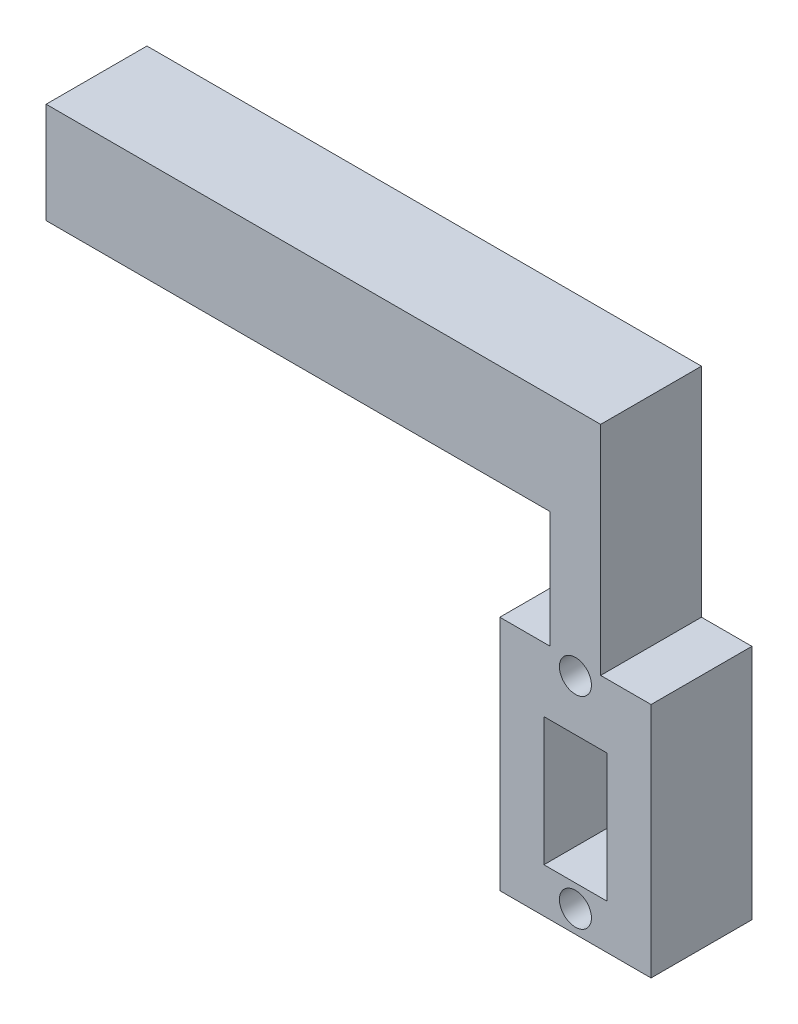
ISO-10303-21;
HEADER;
FILE_DESCRIPTION(('STEP AP214'),'2;1');
FILE_NAME('part.step','',(''),(''),'','','');
FILE_SCHEMA(('AUTOMOTIVE_DESIGN { 1 0 10303 214 1 1 1 1 }'));
ENDSEC;
DATA;
#1=APPLICATION_CONTEXT('core data for automotive mechanical design processes');
#2=APPLICATION_PROTOCOL_DEFINITION('international standard','automotive_design',2000,#1);
#3=PRODUCT_CONTEXT('',#1,'mechanical');
#4=PRODUCT('Part','Part','',(#3));
#5=PRODUCT_RELATED_PRODUCT_CATEGORY('part','',(#4));
#6=PRODUCT_DEFINITION_FORMATION('','',#4);
#7=PRODUCT_DEFINITION_CONTEXT('part definition',#1,'design');
#8=PRODUCT_DEFINITION('design','',#6,#7);
#9=PRODUCT_DEFINITION_SHAPE('','',#8);
#10=(LENGTH_UNIT() NAMED_UNIT(*) SI_UNIT(.MILLI.,.METRE.));
#11=(NAMED_UNIT(*) PLANE_ANGLE_UNIT() SI_UNIT($,.RADIAN.));
#12=(NAMED_UNIT(*) SI_UNIT($,.STERADIAN.) SOLID_ANGLE_UNIT());
#13=UNCERTAINTY_MEASURE_WITH_UNIT(LENGTH_MEASURE(1.E-05),#10,'distance_accuracy_value','');
#14=(GEOMETRIC_REPRESENTATION_CONTEXT(3) GLOBAL_UNCERTAINTY_ASSIGNED_CONTEXT((#13)) GLOBAL_UNIT_ASSIGNED_CONTEXT((#10,
#11,#12)) REPRESENTATION_CONTEXT('',''));
#15=CARTESIAN_POINT('',(0.,0.,0.));
#16=DIRECTION('',(0.,0.,1.));
#17=DIRECTION('',(1.,0.,0.));
#18=AXIS2_PLACEMENT_3D('',#15,#16,#17);
#19=CARTESIAN_POINT('',(0.,0.,20.));
#20=DIRECTION('',(0.,0.,1.));
#21=DIRECTION('',(1.,0.,0.));
#22=AXIS2_PLACEMENT_3D('',#19,#20,#21);
#23=PLANE('',#22);
#24=CARTESIAN_POINT('',(50.,-35.7078480614389,20.));
#25=DIRECTION('',(0.,0.,1.));
#26=DIRECTION('',(1.,0.,0.));
#27=AXIS2_PLACEMENT_3D('',#24,#25,#26);
#28=CIRCLE('',#27,3.175);
#29=CARTESIAN_POINT('',(53.175,-35.7078480614389,20.));
#30=VERTEX_POINT('',#29);
#31=EDGE_CURVE('E182',#30,#30,#28,.T.);
#32=ORIENTED_EDGE('',*,*,#31,.F.);
#33=EDGE_LOOP('',(#32));
#34=FACE_BOUND('',#33,.T.);
#35=DIRECTION('',(0.,-1.,0.));
#36=VECTOR('',#35,1.);
#37=CARTESIAN_POINT('',(-55.,-10.,20.));
#38=LINE('',#37,#36);
#39=CARTESIAN_POINT('',(-55.,9.99999999999999,20.));
#40=VERTEX_POINT('',#39);
#41=CARTESIAN_POINT('',(-55.,-10.,20.));
#42=VERTEX_POINT('',#41);
#43=EDGE_CURVE('E198',#40,#42,#38,.T.);
#44=ORIENTED_EDGE('',*,*,#43,.T.);
#45=DIRECTION('',(1.,0.,0.));
#46=VECTOR('',#45,1.);
#47=CARTESIAN_POINT('',(-55.,-10.,20.));
#48=LINE('',#47,#46);
#49=CARTESIAN_POINT('',(45.,-10.,20.));
#50=VERTEX_POINT('',#49);
#51=EDGE_CURVE('E202',#42,#50,#48,.T.);
#52=ORIENTED_EDGE('',*,*,#51,.T.);
#53=DIRECTION('',(0.,-1.,0.));
#54=VECTOR('',#53,1.);
#55=CARTESIAN_POINT('',(45.,-33.1280466006469,20.));
#56=LINE('',#55,#54);
#57=CARTESIAN_POINT('',(45.,-33.1280466006469,20.));
#58=VERTEX_POINT('',#57);
#59=EDGE_CURVE('E206',#50,#58,#56,.T.);
#60=ORIENTED_EDGE('',*,*,#59,.T.);
#61=DIRECTION('',(-1.,0.,0.));
#62=VECTOR('',#61,1.);
#63=CARTESIAN_POINT('',(35.,-33.1280466006469,20.));
#64=LINE('',#63,#62);
#65=CARTESIAN_POINT('',(35.,-33.1280466006469,20.));
#66=VERTEX_POINT('',#65);
#67=EDGE_CURVE('E209',#58,#66,#64,.T.);
#68=ORIENTED_EDGE('',*,*,#67,.T.);
#69=DIRECTION('',(0.,-1.,0.));
#70=VECTOR('',#69,1.);
#71=CARTESIAN_POINT('',(35.,-33.1280466006469,20.));
#72=LINE('',#71,#70);
#73=CARTESIAN_POINT('',(35.,-80.109447540218,20.));
#74=VERTEX_POINT('',#73);
#75=EDGE_CURVE('E212',#66,#74,#72,.T.);
#76=ORIENTED_EDGE('',*,*,#75,.T.);
#77=DIRECTION('',(1.,0.,0.));
#78=VECTOR('',#77,1.);
#79=CARTESIAN_POINT('',(35.,-80.109447540218,20.));
#80=LINE('',#79,#78);
#81=CARTESIAN_POINT('',(65.,-80.109447540218,20.));
#82=VERTEX_POINT('',#81);
#83=EDGE_CURVE('E215',#74,#82,#80,.T.);
#84=ORIENTED_EDGE('',*,*,#83,.T.);
#85=DIRECTION('',(0.,1.,0.));
#86=VECTOR('',#85,1.);
#87=CARTESIAN_POINT('',(65.,-33.1280466006469,20.));
#88=LINE('',#87,#86);
#89=CARTESIAN_POINT('',(65.,-33.1280466006469,20.));
#90=VERTEX_POINT('',#89);
#91=EDGE_CURVE('E218',#82,#90,#88,.T.);
#92=ORIENTED_EDGE('',*,*,#91,.T.);
#93=DIRECTION('',(-1.,0.,0.));
#94=VECTOR('',#93,1.);
#95=CARTESIAN_POINT('',(55.,-33.1280466006469,20.));
#96=LINE('',#95,#94);
#97=CARTESIAN_POINT('',(55.,-33.1280466006469,20.));
#98=VERTEX_POINT('',#97);
#99=EDGE_CURVE('E221',#90,#98,#96,.T.);
#100=ORIENTED_EDGE('',*,*,#99,.T.);
#101=DIRECTION('',(0.,1.,0.));
#102=VECTOR('',#101,1.);
#103=CARTESIAN_POINT('',(55.,-10.,20.));
#104=LINE('',#103,#102);
#105=CARTESIAN_POINT('',(55.,10.,20.));
#106=VERTEX_POINT('',#105);
#107=EDGE_CURVE('E224',#98,#106,#104,.T.);
#108=ORIENTED_EDGE('',*,*,#107,.T.);
#109=DIRECTION('',(-1.,0.,0.));
#110=VECTOR('',#109,1.);
#111=CARTESIAN_POINT('',(55.,10.,20.));
#112=LINE('',#111,#110);
#113=EDGE_CURVE('E227',#106,#40,#112,.T.);
#114=ORIENTED_EDGE('',*,*,#113,.T.);
#115=EDGE_LOOP('',(#44,#52,#60,#68,#76,#84,#92,#100,#108,#114));
#116=FACE_BOUND('',#115,.T.);
#117=DIRECTION('',(1.,0.,0.));
#118=VECTOR('',#117,1.);
#119=CARTESIAN_POINT('',(43.75,-71.2786939531808,20.));
#120=LINE('',#119,#118);
#121=CARTESIAN_POINT('',(43.75,-71.2786939531808,20.));
#122=VERTEX_POINT('',#121);
#123=CARTESIAN_POINT('',(56.25,-71.2786939531808,20.));
#124=VERTEX_POINT('',#123);
#125=EDGE_CURVE('E156',#122,#124,#120,.T.);
#126=ORIENTED_EDGE('',*,*,#125,.F.);
#127=DIRECTION('',(0.,-1.,0.));
#128=VECTOR('',#127,1.);
#129=CARTESIAN_POINT('',(43.75,-45.8304351109131,20.));
#130=LINE('',#129,#128);
#131=CARTESIAN_POINT('',(43.75,-45.8304351109131,20.));
#132=VERTEX_POINT('',#131);
#133=EDGE_CURVE('E147',#132,#122,#130,.T.);
#134=ORIENTED_EDGE('',*,*,#133,.F.);
#135=DIRECTION('',(-1.,0.,0.));
#136=VECTOR('',#135,1.);
#137=CARTESIAN_POINT('',(43.75,-45.8304351109131,20.));
#138=LINE('',#137,#136);
#139=CARTESIAN_POINT('',(56.25,-45.8304351109131,20.));
#140=VERTEX_POINT('',#139);
#141=EDGE_CURVE('E174',#140,#132,#138,.T.);
#142=ORIENTED_EDGE('',*,*,#141,.F.);
#143=DIRECTION('',(0.,1.,0.));
#144=VECTOR('',#143,1.);
#145=CARTESIAN_POINT('',(56.25,-45.8304351109131,20.));
#146=LINE('',#145,#144);
#147=EDGE_CURVE('E170',#124,#140,#146,.T.);
#148=ORIENTED_EDGE('',*,*,#147,.F.);
#149=EDGE_LOOP('',(#126,#134,#142,#148));
#150=FACE_BOUND('',#149,.T.);
#151=CARTESIAN_POINT('',(50.,-75.7078480614389,20.));
#152=DIRECTION('',(0.,0.,1.));
#153=DIRECTION('',(1.,0.,0.));
#154=AXIS2_PLACEMENT_3D('',#151,#152,#153);
#155=CIRCLE('',#154,3.175);
#156=CARTESIAN_POINT('',(53.175,-75.7078480614389,20.));
#157=VERTEX_POINT('',#156);
#158=EDGE_CURVE('E520',#157,#157,#155,.T.);
#159=ORIENTED_EDGE('',*,*,#158,.F.);
#160=EDGE_LOOP('',(#159));
#161=FACE_BOUND('',#160,.T.);
#162=ADVANCED_FACE('F39',(#34,#116,#150,#161),#23,.T.);
#163=CARTESIAN_POINT('',(0.,0.,0.));
#164=DIRECTION('',(0.,0.,1.));
#165=DIRECTION('',(1.,0.,0.));
#166=AXIS2_PLACEMENT_3D('',#163,#164,#165);
#167=PLANE('',#166);
#168=DIRECTION('',(0.,-1.,0.));
#169=VECTOR('',#168,1.);
#170=CARTESIAN_POINT('',(-55.,-10.,0.));
#171=LINE('',#170,#169);
#172=CARTESIAN_POINT('',(-55.,9.99999999999999,0.));
#173=VERTEX_POINT('',#172);
#174=CARTESIAN_POINT('',(-55.,-10.,0.));
#175=VERTEX_POINT('',#174);
#176=EDGE_CURVE('E165',#173,#175,#171,.T.);
#177=ORIENTED_EDGE('',*,*,#176,.F.);
#178=DIRECTION('',(-1.,0.,0.));
#179=VECTOR('',#178,1.);
#180=CARTESIAN_POINT('',(55.,10.,0.));
#181=LINE('',#180,#179);
#182=CARTESIAN_POINT('',(55.,10.,0.));
#183=VERTEX_POINT('',#182);
#184=EDGE_CURVE('E203',#183,#173,#181,.T.);
#185=ORIENTED_EDGE('',*,*,#184,.F.);
#186=DIRECTION('',(0.,1.,0.));
#187=VECTOR('',#186,1.);
#188=CARTESIAN_POINT('',(55.,-10.,0.));
#189=LINE('',#188,#187);
#190=CARTESIAN_POINT('',(55.,-33.1280466006469,0.));
#191=VERTEX_POINT('',#190);
#192=EDGE_CURVE('E256',#191,#183,#189,.T.);
#193=ORIENTED_EDGE('',*,*,#192,.F.);
#194=DIRECTION('',(-1.,0.,0.));
#195=VECTOR('',#194,1.);
#196=CARTESIAN_POINT('',(55.,-33.1280466006469,0.));
#197=LINE('',#196,#195);
#198=CARTESIAN_POINT('',(65.,-33.1280466006469,0.));
#199=VERTEX_POINT('',#198);
#200=EDGE_CURVE('E252',#199,#191,#197,.T.);
#201=ORIENTED_EDGE('',*,*,#200,.F.);
#202=DIRECTION('',(0.,1.,0.));
#203=VECTOR('',#202,1.);
#204=CARTESIAN_POINT('',(65.,-33.1280466006469,0.));
#205=LINE('',#204,#203);
#206=CARTESIAN_POINT('',(65.,-80.109447540218,0.));
#207=VERTEX_POINT('',#206);
#208=EDGE_CURVE('E249',#207,#199,#205,.T.);
#209=ORIENTED_EDGE('',*,*,#208,.F.);
#210=DIRECTION('',(1.,0.,0.));
#211=VECTOR('',#210,1.);
#212=CARTESIAN_POINT('',(35.,-80.109447540218,0.));
#213=LINE('',#212,#211);
#214=CARTESIAN_POINT('',(35.,-80.109447540218,0.));
#215=VERTEX_POINT('',#214);
#216=EDGE_CURVE('E246',#215,#207,#213,.T.);
#217=ORIENTED_EDGE('',*,*,#216,.F.);
#218=DIRECTION('',(0.,-1.,0.));
#219=VECTOR('',#218,1.);
#220=CARTESIAN_POINT('',(35.,-33.1280466006469,0.));
#221=LINE('',#220,#219);
#222=CARTESIAN_POINT('',(35.,-33.1280466006469,0.));
#223=VERTEX_POINT('',#222);
#224=EDGE_CURVE('E243',#223,#215,#221,.T.);
#225=ORIENTED_EDGE('',*,*,#224,.F.);
#226=DIRECTION('',(-1.,0.,0.));
#227=VECTOR('',#226,1.);
#228=CARTESIAN_POINT('',(35.,-33.1280466006469,0.));
#229=LINE('',#228,#227);
#230=CARTESIAN_POINT('',(45.,-33.1280466006469,0.));
#231=VERTEX_POINT('',#230);
#232=EDGE_CURVE('E240',#231,#223,#229,.T.);
#233=ORIENTED_EDGE('',*,*,#232,.F.);
#234=DIRECTION('',(0.,-1.,0.));
#235=VECTOR('',#234,1.);
#236=CARTESIAN_POINT('',(45.,-33.1280466006469,0.));
#237=LINE('',#236,#235);
#238=CARTESIAN_POINT('',(45.,-10.,0.));
#239=VERTEX_POINT('',#238);
#240=EDGE_CURVE('E237',#239,#231,#237,.T.);
#241=ORIENTED_EDGE('',*,*,#240,.F.);
#242=DIRECTION('',(1.,0.,0.));
#243=VECTOR('',#242,1.);
#244=CARTESIAN_POINT('',(-55.,-10.,0.));
#245=LINE('',#244,#243);
#246=EDGE_CURVE('E234',#175,#239,#245,.T.);
#247=ORIENTED_EDGE('',*,*,#246,.F.);
#248=EDGE_LOOP('',(#177,#185,#193,#201,#209,#217,#225,#233,#241,#247));
#249=FACE_BOUND('',#248,.T.);
#250=DIRECTION('',(0.,-1.,0.));
#251=VECTOR('',#250,1.);
#252=CARTESIAN_POINT('',(43.75,-45.8304351109131,0.));
#253=LINE('',#252,#251);
#254=CARTESIAN_POINT('',(43.75,-45.8304351109131,0.));
#255=VERTEX_POINT('',#254);
#256=CARTESIAN_POINT('',(43.75,-71.2786939531808,0.));
#257=VERTEX_POINT('',#256);
#258=EDGE_CURVE('E69',#255,#257,#253,.T.);
#259=ORIENTED_EDGE('',*,*,#258,.T.);
#260=DIRECTION('',(1.,0.,0.));
#261=VECTOR('',#260,1.);
#262=CARTESIAN_POINT('',(43.75,-71.2786939531808,0.));
#263=LINE('',#262,#261);
#264=CARTESIAN_POINT('',(56.25,-71.2786939531808,0.));
#265=VERTEX_POINT('',#264);
#266=EDGE_CURVE('E163',#257,#265,#263,.T.);
#267=ORIENTED_EDGE('',*,*,#266,.T.);
#268=DIRECTION('',(0.,1.,0.));
#269=VECTOR('',#268,1.);
#270=CARTESIAN_POINT('',(56.25,-45.8304351109131,0.));
#271=LINE('',#270,#269);
#272=CARTESIAN_POINT('',(56.25,-45.8304351109131,0.));
#273=VERTEX_POINT('',#272);
#274=EDGE_CURVE('E185',#265,#273,#271,.T.);
#275=ORIENTED_EDGE('',*,*,#274,.T.);
#276=DIRECTION('',(-1.,0.,0.));
#277=VECTOR('',#276,1.);
#278=CARTESIAN_POINT('',(43.75,-45.8304351109131,0.));
#279=LINE('',#278,#277);
#280=EDGE_CURVE('E157',#273,#255,#279,.T.);
#281=ORIENTED_EDGE('',*,*,#280,.T.);
#282=EDGE_LOOP('',(#259,#267,#275,#281));
#283=FACE_BOUND('',#282,.T.);
#284=CARTESIAN_POINT('',(50.,-35.7078480614389,0.));
#285=DIRECTION('',(0.,0.,1.));
#286=DIRECTION('',(1.,0.,0.));
#287=AXIS2_PLACEMENT_3D('',#284,#285,#286);
#288=CIRCLE('',#287,3.175);
#289=CARTESIAN_POINT('',(53.175,-35.7078480614389,0.));
#290=VERTEX_POINT('',#289);
#291=EDGE_CURVE('E524',#290,#290,#288,.T.);
#292=ORIENTED_EDGE('',*,*,#291,.T.);
#293=EDGE_LOOP('',(#292));
#294=FACE_BOUND('',#293,.T.);
#295=CARTESIAN_POINT('',(50.,-75.7078480614389,0.));
#296=DIRECTION('',(0.,0.,1.));
#297=DIRECTION('',(1.,0.,0.));
#298=AXIS2_PLACEMENT_3D('',#295,#296,#297);
#299=CIRCLE('',#298,3.175);
#300=CARTESIAN_POINT('',(53.175,-75.7078480614389,0.));
#301=VERTEX_POINT('',#300);
#302=EDGE_CURVE('E518',#301,#301,#299,.T.);
#303=ORIENTED_EDGE('',*,*,#302,.T.);
#304=EDGE_LOOP('',(#303));
#305=FACE_BOUND('',#304,.T.);
#306=ADVANCED_FACE('F304',(#249,#283,#294,#305),#167,.F.);
#307=CARTESIAN_POINT('',(-55.,-10.,20.));
#308=DIRECTION('',(1.,0.,0.));
#309=DIRECTION('',(0.,0.,-1.));
#310=AXIS2_PLACEMENT_3D('',#307,#308,#309);
#311=PLANE('',#310);
#312=ORIENTED_EDGE('',*,*,#176,.T.);
#313=DIRECTION('',(0.,0.,-1.));
#314=VECTOR('',#313,1.);
#315=CARTESIAN_POINT('',(-55.,-10.,20.));
#316=LINE('',#315,#314);
#317=EDGE_CURVE('E11',#42,#175,#316,.T.);
#318=ORIENTED_EDGE('',*,*,#317,.F.);
#319=ORIENTED_EDGE('',*,*,#43,.F.);
#320=DIRECTION('',(0.,0.,-1.));
#321=VECTOR('',#320,1.);
#322=CARTESIAN_POINT('',(-55.,9.99999999999999,20.));
#323=LINE('',#322,#321);
#324=EDGE_CURVE('E230',#40,#173,#323,.T.);
#325=ORIENTED_EDGE('',*,*,#324,.T.);
#326=EDGE_LOOP('',(#312,#318,#319,#325));
#327=FACE_BOUND('',#326,.T.);
#328=ADVANCED_FACE('F41',(#327),#311,.F.);
#329=CARTESIAN_POINT('',(-55.,-10.,20.));
#330=DIRECTION('',(0.,1.,0.));
#331=DIRECTION('',(-1.,0.,0.));
#332=AXIS2_PLACEMENT_3D('',#329,#330,#331);
#333=PLANE('',#332);
#334=ORIENTED_EDGE('',*,*,#246,.T.);
#335=DIRECTION('',(0.,0.,-1.));
#336=VECTOR('',#335,1.);
#337=CARTESIAN_POINT('',(45.,-10.,20.));
#338=LINE('',#337,#336);
#339=EDGE_CURVE('E54',#50,#239,#338,.T.);
#340=ORIENTED_EDGE('',*,*,#339,.F.);
#341=ORIENTED_EDGE('',*,*,#51,.F.);
#342=ORIENTED_EDGE('',*,*,#317,.T.);
#343=EDGE_LOOP('',(#334,#340,#341,#342));
#344=FACE_BOUND('',#343,.T.);
#345=ADVANCED_FACE('F321',(#344),#333,.F.);
#346=CARTESIAN_POINT('',(45.,-33.1280466006469,20.));
#347=DIRECTION('',(1.,0.,0.));
#348=DIRECTION('',(0.,0.,-1.));
#349=AXIS2_PLACEMENT_3D('',#346,#347,#348);
#350=PLANE('',#349);
#351=ORIENTED_EDGE('',*,*,#240,.T.);
#352=DIRECTION('',(0.,0.,-1.));
#353=VECTOR('',#352,1.);
#354=CARTESIAN_POINT('',(45.,-33.1280466006469,20.));
#355=LINE('',#354,#353);
#356=EDGE_CURVE('E288',#58,#231,#355,.T.);
#357=ORIENTED_EDGE('',*,*,#356,.F.);
#358=ORIENTED_EDGE('',*,*,#59,.F.);
#359=ORIENTED_EDGE('',*,*,#339,.T.);
#360=EDGE_LOOP('',(#351,#357,#358,#359));
#361=FACE_BOUND('',#360,.T.);
#362=ADVANCED_FACE('F298',(#361),#350,.F.);
#363=CARTESIAN_POINT('',(35.,-33.1280466006469,20.));
#364=DIRECTION('',(0.,-1.,0.));
#365=DIRECTION('',(0.,0.,-1.));
#366=AXIS2_PLACEMENT_3D('',#363,#364,#365);
#367=PLANE('',#366);
#368=ORIENTED_EDGE('',*,*,#232,.T.);
#369=DIRECTION('',(0.,0.,-1.));
#370=VECTOR('',#369,1.);
#371=CARTESIAN_POINT('',(35.,-33.1280466006469,20.));
#372=LINE('',#371,#370);
#373=EDGE_CURVE('E284',#66,#223,#372,.T.);
#374=ORIENTED_EDGE('',*,*,#373,.F.);
#375=ORIENTED_EDGE('',*,*,#67,.F.);
#376=ORIENTED_EDGE('',*,*,#356,.T.);
#377=EDGE_LOOP('',(#368,#374,#375,#376));
#378=FACE_BOUND('',#377,.T.);
#379=ADVANCED_FACE('F310',(#378),#367,.F.);
#380=CARTESIAN_POINT('',(35.,-33.1280466006469,20.));
#381=DIRECTION('',(1.,0.,0.));
#382=DIRECTION('',(0.,1.,0.));
#383=AXIS2_PLACEMENT_3D('',#380,#381,#382);
#384=PLANE('',#383);
#385=ORIENTED_EDGE('',*,*,#224,.T.);
#386=DIRECTION('',(0.,0.,-1.));
#387=VECTOR('',#386,1.);
#388=CARTESIAN_POINT('',(35.,-80.109447540218,20.));
#389=LINE('',#388,#387);
#390=EDGE_CURVE('E280',#74,#215,#389,.T.);
#391=ORIENTED_EDGE('',*,*,#390,.F.);
#392=ORIENTED_EDGE('',*,*,#75,.F.);
#393=ORIENTED_EDGE('',*,*,#373,.T.);
#394=EDGE_LOOP('',(#385,#391,#392,#393));
#395=FACE_BOUND('',#394,.T.);
#396=ADVANCED_FACE('F314',(#395),#384,.F.);
#397=CARTESIAN_POINT('',(35.,-80.109447540218,20.));
#398=DIRECTION('',(0.,1.,0.));
#399=DIRECTION('',(-1.,0.,0.));
#400=AXIS2_PLACEMENT_3D('',#397,#398,#399);
#401=PLANE('',#400);
#402=ORIENTED_EDGE('',*,*,#216,.T.);
#403=DIRECTION('',(0.,0.,-1.));
#404=VECTOR('',#403,1.);
#405=CARTESIAN_POINT('',(65.,-80.109447540218,20.));
#406=LINE('',#405,#404);
#407=EDGE_CURVE('E276',#82,#207,#406,.T.);
#408=ORIENTED_EDGE('',*,*,#407,.F.);
#409=ORIENTED_EDGE('',*,*,#83,.F.);
#410=ORIENTED_EDGE('',*,*,#390,.T.);
#411=EDGE_LOOP('',(#402,#408,#409,#410));
#412=FACE_BOUND('',#411,.T.);
#413=ADVANCED_FACE('F343',(#412),#401,.F.);
#414=CARTESIAN_POINT('',(65.,-33.1280466006469,20.));
#415=DIRECTION('',(-1.,0.,0.));
#416=DIRECTION('',(0.,-1.,0.));
#417=AXIS2_PLACEMENT_3D('',#414,#415,#416);
#418=PLANE('',#417);
#419=ORIENTED_EDGE('',*,*,#208,.T.);
#420=DIRECTION('',(0.,0.,-1.));
#421=VECTOR('',#420,1.);
#422=CARTESIAN_POINT('',(65.,-33.1280466006469,20.));
#423=LINE('',#422,#421);
#424=EDGE_CURVE('E272',#90,#199,#423,.T.);
#425=ORIENTED_EDGE('',*,*,#424,.F.);
#426=ORIENTED_EDGE('',*,*,#91,.F.);
#427=ORIENTED_EDGE('',*,*,#407,.T.);
#428=EDGE_LOOP('',(#419,#425,#426,#427));
#429=FACE_BOUND('',#428,.T.);
#430=ADVANCED_FACE('F340',(#429),#418,.F.);
#431=CARTESIAN_POINT('',(55.,-33.1280466006469,20.));
#432=DIRECTION('',(0.,-1.,0.));
#433=DIRECTION('',(0.,0.,-1.));
#434=AXIS2_PLACEMENT_3D('',#431,#432,#433);
#435=PLANE('',#434);
#436=ORIENTED_EDGE('',*,*,#200,.T.);
#437=DIRECTION('',(0.,0.,-1.));
#438=VECTOR('',#437,1.);
#439=CARTESIAN_POINT('',(55.,-33.1280466006469,20.));
#440=LINE('',#439,#438);
#441=EDGE_CURVE('E268',#98,#191,#440,.T.);
#442=ORIENTED_EDGE('',*,*,#441,.F.);
#443=ORIENTED_EDGE('',*,*,#99,.F.);
#444=ORIENTED_EDGE('',*,*,#424,.T.);
#445=EDGE_LOOP('',(#436,#442,#443,#444));
#446=FACE_BOUND('',#445,.T.);
#447=ADVANCED_FACE('F336',(#446),#435,.F.);
#448=CARTESIAN_POINT('',(55.,-10.,20.));
#449=DIRECTION('',(-1.,0.,0.));
#450=DIRECTION('',(0.,0.,1.));
#451=AXIS2_PLACEMENT_3D('',#448,#449,#450);
#452=PLANE('',#451);
#453=ORIENTED_EDGE('',*,*,#192,.T.);
#454=DIRECTION('',(0.,0.,-1.));
#455=VECTOR('',#454,1.);
#456=CARTESIAN_POINT('',(55.,10.,20.));
#457=LINE('',#456,#455);
#458=EDGE_CURVE('E264',#106,#183,#457,.T.);
#459=ORIENTED_EDGE('',*,*,#458,.F.);
#460=ORIENTED_EDGE('',*,*,#107,.F.);
#461=ORIENTED_EDGE('',*,*,#441,.T.);
#462=EDGE_LOOP('',(#453,#459,#460,#461));
#463=FACE_BOUND('',#462,.T.);
#464=ADVANCED_FACE('F332',(#463),#452,.F.);
#465=CARTESIAN_POINT('',(55.,10.,20.));
#466=DIRECTION('',(0.,-1.,0.));
#467=DIRECTION('',(1.,0.,0.));
#468=AXIS2_PLACEMENT_3D('',#465,#466,#467);
#469=PLANE('',#468);
#470=ORIENTED_EDGE('',*,*,#184,.T.);
#471=ORIENTED_EDGE('',*,*,#324,.F.);
#472=ORIENTED_EDGE('',*,*,#113,.F.);
#473=ORIENTED_EDGE('',*,*,#458,.T.);
#474=EDGE_LOOP('',(#470,#471,#472,#473));
#475=FACE_BOUND('',#474,.T.);
#476=ADVANCED_FACE('F327',(#475),#469,.F.);
#477=CARTESIAN_POINT('',(43.75,-45.8304351109131,20.));
#478=DIRECTION('',(1.,0.,0.));
#479=DIRECTION('',(0.,1.,0.));
#480=AXIS2_PLACEMENT_3D('',#477,#478,#479);
#481=PLANE('',#480);
#482=ORIENTED_EDGE('',*,*,#258,.F.);
#483=DIRECTION('',(0.,0.,-1.));
#484=VECTOR('',#483,1.);
#485=CARTESIAN_POINT('',(43.75,-45.8304351109131,20.));
#486=LINE('',#485,#484);
#487=EDGE_CURVE('E151',#132,#255,#486,.T.);
#488=ORIENTED_EDGE('',*,*,#487,.F.);
#489=ORIENTED_EDGE('',*,*,#133,.T.);
#490=DIRECTION('',(0.,0.,-1.));
#491=VECTOR('',#490,1.);
#492=CARTESIAN_POINT('',(43.75,-71.2786939531808,20.));
#493=LINE('',#492,#491);
#494=EDGE_CURVE('E150',#122,#257,#493,.T.);
#495=ORIENTED_EDGE('',*,*,#494,.T.);
#496=EDGE_LOOP('',(#482,#488,#489,#495));
#497=FACE_BOUND('',#496,.T.);
#498=ADVANCED_FACE('F149',(#497),#481,.T.);
#499=CARTESIAN_POINT('',(43.75,-71.2786939531808,20.));
#500=DIRECTION('',(0.,1.,0.));
#501=DIRECTION('',(0.,0.,1.));
#502=AXIS2_PLACEMENT_3D('',#499,#500,#501);
#503=PLANE('',#502);
#504=ORIENTED_EDGE('',*,*,#266,.F.);
#505=ORIENTED_EDGE('',*,*,#494,.F.);
#506=ORIENTED_EDGE('',*,*,#125,.T.);
#507=DIRECTION('',(0.,0.,-1.));
#508=VECTOR('',#507,1.);
#509=CARTESIAN_POINT('',(56.25,-71.2786939531808,20.));
#510=LINE('',#509,#508);
#511=EDGE_CURVE('E166',#124,#265,#510,.T.);
#512=ORIENTED_EDGE('',*,*,#511,.T.);
#513=EDGE_LOOP('',(#504,#505,#506,#512));
#514=FACE_BOUND('',#513,.T.);
#515=ADVANCED_FACE('F160',(#514),#503,.T.);
#516=CARTESIAN_POINT('',(56.25,-45.8304351109131,20.));
#517=DIRECTION('',(-1.,0.,0.));
#518=DIRECTION('',(0.,0.,1.));
#519=AXIS2_PLACEMENT_3D('',#516,#517,#518);
#520=PLANE('',#519);
#521=ORIENTED_EDGE('',*,*,#274,.F.);
#522=ORIENTED_EDGE('',*,*,#511,.F.);
#523=ORIENTED_EDGE('',*,*,#147,.T.);
#524=DIRECTION('',(0.,0.,-1.));
#525=VECTOR('',#524,1.);
#526=CARTESIAN_POINT('',(56.25,-45.8304351109131,20.));
#527=LINE('',#526,#525);
#528=EDGE_CURVE('E61',#140,#273,#527,.T.);
#529=ORIENTED_EDGE('',*,*,#528,.T.);
#530=EDGE_LOOP('',(#521,#522,#523,#529));
#531=FACE_BOUND('',#530,.T.);
#532=ADVANCED_FACE('F391',(#531),#520,.T.);
#533=CARTESIAN_POINT('',(43.75,-45.8304351109131,20.));
#534=DIRECTION('',(0.,-1.,0.));
#535=DIRECTION('',(0.,0.,-1.));
#536=AXIS2_PLACEMENT_3D('',#533,#534,#535);
#537=PLANE('',#536);
#538=CARTESIAN_POINT('',(50.,-45.8304351109131,10.));
#539=DIRECTION('',(0.,-1.,0.));
#540=DIRECTION('',(0.,0.,-1.));
#541=AXIS2_PLACEMENT_3D('',#538,#539,#540);
#542=CIRCLE('',#541,2.5);
#543=CARTESIAN_POINT('',(50.,-45.8304351109131,7.5));
#544=VERTEX_POINT('',#543);
#545=EDGE_CURVE('E514',#544,#544,#542,.T.);
#546=ORIENTED_EDGE('',*,*,#545,.F.);
#547=EDGE_LOOP('',(#546));
#548=FACE_BOUND('',#547,.T.);
#549=ORIENTED_EDGE('',*,*,#280,.F.);
#550=ORIENTED_EDGE('',*,*,#528,.F.);
#551=ORIENTED_EDGE('',*,*,#141,.T.);
#552=ORIENTED_EDGE('',*,*,#487,.T.);
#553=EDGE_LOOP('',(#549,#550,#551,#552));
#554=FACE_BOUND('',#553,.T.);
#555=ADVANCED_FACE('F397',(#548,#554),#537,.T.);
#556=CARTESIAN_POINT('',(50.,-35.7078480614389,20.));
#557=DIRECTION('',(0.,0.,-1.));
#558=DIRECTION('',(-1.,0.,0.));
#559=AXIS2_PLACEMENT_3D('',#556,#557,#558);
#560=CYLINDRICAL_SURFACE('',#559,3.175);
#561=CARTESIAN_POINT('',(50.,-38.8828480614389,7.5));
#562=CARTESIAN_POINT('',(49.8794564824427,-38.8828384256056,7.50000996103096));
#563=CARTESIAN_POINT('',(49.7587544329421,-38.8759130358371,7.50878938740901));
#564=CARTESIAN_POINT('',(49.5212272093894,-38.8488300699185,7.54332482089816));
#565=CARTESIAN_POINT('',(49.4044103532432,-38.8286458108458,7.5691150619956));
#566=CARTESIAN_POINT('',(49.1787202412155,-38.7769599678967,7.6358373296574));
#567=CARTESIAN_POINT('',(49.0698024516276,-38.7455289247793,7.67667502381935));
#568=CARTESIAN_POINT('',(48.861180105732,-38.6736384294574,7.7714938254729));
#569=CARTESIAN_POINT('',(48.7614760335955,-38.6331785031758,7.82547562313196));
#570=CARTESIAN_POINT('',(48.5400831729872,-38.5307494050171,7.96502676213563));
#571=CARTESIAN_POINT('',(48.4224541856346,-38.4661454131127,8.05509458591361));
#572=CARTESIAN_POINT('',(48.2062705585205,-38.3307218873488,8.25241254272063));
#573=CARTESIAN_POINT('',(48.1077721210028,-38.2598849020798,8.35971166043252));
#574=CARTESIAN_POINT('',(47.9743433993035,-38.1533867331914,8.53298857009249));
#575=CARTESIAN_POINT('',(47.93199104202,-38.1175770391849,8.59330291667681));
#576=CARTESIAN_POINT('',(47.8525018748242,-38.0470136952206,8.71792412253822));
#577=CARTESIAN_POINT('',(47.8153666471134,-38.0122603681211,8.78223218450134));
#578=CARTESIAN_POINT('',(47.7466512511124,-37.9451110933548,8.9146579799743));
#579=CARTESIAN_POINT('',(47.7150555420781,-37.9127087052153,8.98276432540567));
#580=CARTESIAN_POINT('',(47.6576738491433,-37.851650053196,9.12293719833325));
#581=CARTESIAN_POINT('',(47.6318829820816,-37.8229906492193,9.19500033332118));
#582=CARTESIAN_POINT('',(47.5827357276207,-37.7667516224476,9.35575889723093));
#583=CARTESIAN_POINT('',(47.5605509273172,-37.7401957743757,9.44519043784298));
#584=CARTESIAN_POINT('',(47.5260345389775,-37.6980440125372,9.62833356533921));
#585=CARTESIAN_POINT('',(47.5136794153201,-37.6824219304451,9.72203435740244));
#586=CARTESIAN_POINT('',(47.4997085579738,-37.6647116898316,9.9123146320585));
#587=CARTESIAN_POINT('',(47.4981754964677,-37.6627277189333,10.0089106255964));
#588=CARTESIAN_POINT('',(47.5062288716641,-37.672984253001,10.2009091250307));
#589=CARTESIAN_POINT('',(47.5158265791652,-37.6852391760151,10.2963103221539));
#590=CARTESIAN_POINT('',(47.5478916212808,-37.7249071454701,10.4995587062841));
#591=CARTESIAN_POINT('',(47.5723344623772,-37.754617267985,10.6066239026509));
#592=CARTESIAN_POINT('',(47.6335582426402,-37.8250955588021,10.8134238376436));
#593=CARTESIAN_POINT('',(47.6703742831026,-37.8658951228339,10.913136726119));
#594=CARTESIAN_POINT('',(47.7433470477832,-37.9417045595864,11.0785641509713));
#595=CARTESIAN_POINT('',(47.776936310026,-37.9752512204775,11.1461249556209));
#596=CARTESIAN_POINT('',(47.8495790184851,-38.0442619965704,11.2772264076175));
#597=CARTESIAN_POINT('',(47.8886347572784,-38.0797269124174,11.340765351922));
#598=CARTESIAN_POINT('',(48.0137792628872,-38.1872856143153,11.5254782971294));
#599=CARTESIAN_POINT('',(48.1078330220105,-38.2605297839348,11.6407209373447));
#600=CARTESIAN_POINT('',(48.3185051836695,-38.4041139257805,11.856270682226));
#601=CARTESIAN_POINT('',(48.4355407710767,-38.4743654226507,11.9562293193733));
#602=CARTESIAN_POINT('',(48.6901128128041,-38.6035416980782,12.1349970824416));
#603=CARTESIAN_POINT('',(48.8275907247336,-38.6624977555967,12.2138648597434));
#604=CARTESIAN_POINT('',(49.0774397431988,-38.747831600239,12.3263225008776));
#605=CARTESIAN_POINT('',(49.1853681001116,-38.7786936189606,12.3664081290865));
#606=CARTESIAN_POINT('',(49.4081463779665,-38.8292798345261,12.4316955098301));
#607=CARTESIAN_POINT('',(49.5229909495767,-38.8490125199281,12.4569086066076));
#608=CARTESIAN_POINT('',(49.7571055101828,-38.8757436835961,12.490993889249));
#609=CARTESIAN_POINT('',(49.8763929537929,-38.8826849683492,12.4997926848651));
#610=CARTESIAN_POINT('',(50.1150181862497,-38.883005346047,12.5001999383503));
#611=CARTESIAN_POINT('',(50.2343559717624,-38.8763852282662,12.4918093966399));
#612=CARTESIAN_POINT('',(50.4610471060371,-38.8511234083892,12.4596023520382));
#613=CARTESIAN_POINT('',(50.5686593193995,-38.8333424090108,12.4368897968291));
#614=CARTESIAN_POINT('',(50.7780310464614,-38.7879096973193,12.3783386570784));
#615=CARTESIAN_POINT('',(50.879789148775,-38.7602556161579,12.3424969223994));
#616=CARTESIAN_POINT('',(51.0830559386951,-38.6944635770085,12.2561228815644));
#617=CARTESIAN_POINT('',(51.1839733437085,-38.6556948060346,12.2046902799429));
#618=CARTESIAN_POINT('',(51.3758390958155,-38.5711853864192,12.0903487524284));
#619=CARTESIAN_POINT('',(51.4667830316243,-38.5254416739588,12.0274347808163));
#620=CARTESIAN_POINT('',(51.6548013702625,-38.4200438087229,11.8784792209389));
#621=CARTESIAN_POINT('',(51.7496449378656,-38.3594122962413,11.7903185904549));
#622=CARTESIAN_POINT('',(51.9241137786087,-38.2356657305446,11.6013619616743));
#623=CARTESIAN_POINT('',(52.0037171672562,-38.1725472605337,11.5005481323372));
#624=CARTESIAN_POINT('',(52.145908057684,-38.0497187237408,11.288827207371));
#625=CARTESIAN_POINT('',(52.2087687382827,-37.9899683585444,11.1781274069443));
#626=CARTESIAN_POINT('',(52.3180748944767,-37.8788375582115,10.9450039940111));
#627=CARTESIAN_POINT('',(52.3645547061789,-37.8274397386472,10.8226055964119));
#628=CARTESIAN_POINT('',(52.4267463033985,-37.7555381542197,10.6075265749445));
#629=CARTESIAN_POINT('',(52.4475448998766,-37.7304126035997,10.5178980373666));
#630=CARTESIAN_POINT('',(52.4792441630767,-37.69143497274,10.3345981107572));
#631=CARTESIAN_POINT('',(52.4901673140903,-37.6775572909937,10.2409364167646));
#632=CARTESIAN_POINT('',(52.5012871466879,-37.6634264139353,10.0512664495286));
#633=CARTESIAN_POINT('',(52.5014125591174,-37.663263743023,9.95524676890402));
#634=CARTESIAN_POINT('',(52.4907423433595,-37.6768290712429,9.76477199736144));
#635=CARTESIAN_POINT('',(52.4799335256531,-37.6905738463688,9.67031893604611));
#636=CARTESIAN_POINT('',(52.4449929878175,-37.7335657163766,9.46626207478259));
#637=CARTESIAN_POINT('',(52.4185411575469,-37.7654610122648,9.35763912463532));
#638=CARTESIAN_POINT('',(52.3529692884179,-37.8401262710087,9.14814254636734));
#639=CARTESIAN_POINT('',(52.3138130626494,-37.8829272216158,9.04729208498145));
#640=CARTESIAN_POINT('',(52.2368126828884,-37.9616078567213,8.88082385777522));
#641=CARTESIAN_POINT('',(52.2016668629558,-37.996073319217,8.81324335590009));
#642=CARTESIAN_POINT('',(52.1258141465045,-38.0667087847373,8.68217921134745));
#643=CARTESIAN_POINT('',(52.0851050259013,-38.102879465663,8.61869722218563));
#644=CARTESIAN_POINT('',(51.9982737990069,-38.1757907854249,8.4958188722796));
#645=CARTESIAN_POINT('',(51.9521482156029,-38.212531777097,8.43642517525396));
#646=CARTESIAN_POINT('',(51.8546045092263,-38.2855981828469,8.32187254022173));
#647=CARTESIAN_POINT('',(51.8031836913768,-38.3219233747606,8.26671578367885));
#648=CARTESIAN_POINT('',(51.6393225380925,-38.4300661533154,8.10627544523311));
#649=CARTESIAN_POINT('',(51.5185330699871,-38.4999485250047,8.00780437198924));
#650=CARTESIAN_POINT('',(51.3221492488938,-38.5953844739635,7.87676962689626));
#651=CARTESIAN_POINT('',(51.254197265153,-38.625617459611,7.83588837076972));
#652=CARTESIAN_POINT('',(51.1134542544642,-38.6821688097045,7.76022399589329));
#653=CARTESIAN_POINT('',(51.0406659173201,-38.7084893241876,7.7254375259572));
#654=CARTESIAN_POINT('',(50.8622794946217,-38.7654391256896,7.65073945931969));
#655=CARTESIAN_POINT('',(50.7546872590374,-38.7939309863324,7.61386827713967));
#656=CARTESIAN_POINT('',(50.5334192141109,-38.8397456773122,7.55490186057541));
#657=CARTESIAN_POINT('',(50.4197592652549,-38.8570962173453,7.53276996282522));
#658=CARTESIAN_POINT('',(50.2542563316935,-38.8730586201274,7.51244218959651));
#659=CARTESIAN_POINT('',(50.2036008157511,-38.8767212074097,7.50778492568325));
#660=CARTESIAN_POINT('',(50.1019730418832,-38.8816182618007,7.501561347738));
#661=CARTESIAN_POINT('',(50.0510007099325,-38.8828521382598,7.49999578559128));
#662=CARTESIAN_POINT('',(50.,-38.8828480614389,7.5));
#663=B_SPLINE_CURVE_WITH_KNOTS('',3,(#561,#562,#563,#564,#565,#566,#567,#568,#569,#570,#571,
#572,#573,#574,#575,#576,#577,#578,#579,#580,#581,#582,#583,#584,#585,#586,#587,#588,#589,#590,
#591,#592,#593,#594,#595,#596,#597,#598,#599,#600,#601,#602,#603,#604,#605,#606,#607,#608,#609,
#610,#611,#612,#613,#614,#615,#616,#617,#618,#619,#620,#621,#622,#623,#624,#625,#626,#627,#628,
#629,#630,#631,#632,#633,#634,#635,#636,#637,#638,#639,#640,#641,#642,#643,#644,#645,#646,#647,
#648,#649,#650,#651,#652,#653,#654,#655,#656,#657,#658,#659,#660,#661,#662),.UNSPECIFIED.,.T.,
.F.,(4,2,2,2,2,2,2,2,2,2,2,2,2,2,2,2,2,2,2,2,2,2,2,2,2,2,2,2,2,2,2,2,2,2,2,2,2,2,2,2,2,2,2,2,2,
2,2,2,2,2,4),(0.,0.361410009397382,0.723549578840151,1.08345648570106,1.44338229454484,
1.92575209373793,2.40951825964312,2.65511885135505,2.90079376643014,3.14576802725864,
3.39053543362762,3.67718286007321,3.963141871072,4.25128304659547,4.53971624315608,
4.87914941641498,5.21955376557672,5.46696484786712,5.71448000415844,6.20960820329571,
6.71473157463672,7.21843529075837,7.57458377531813,7.93046024990649,8.28792411093804,
8.64536716814001,8.97815508216214,9.31102289569817,9.66885981095604,10.0268543652165,
10.4542676821161,10.8822902239035,11.3028290080682,11.7224809791469,12.0076014479018,
12.2920711110487,12.5784182384825,12.8651111872218,13.2119760232239,13.5598376647263,
13.8103678287793,14.0609984438483,14.3117908406411,14.5627115087061,15.0717930279793,
15.3260474310264,15.5801615918708,15.9304182570927,16.2798003862346,16.4326720334755,
16.5855808537049),.UNSPECIFIED.);
#664=CARTESIAN_POINT('',(50.,-38.8828480614389,7.5));
#665=VERTEX_POINT('',#664);
#666=EDGE_CURVE('E43',#665,#665,#663,.T.);
#667=ORIENTED_EDGE('',*,*,#666,.F.);
#668=EDGE_LOOP('',(#667));
#669=FACE_BOUND('',#668,.T.);
#670=ORIENTED_EDGE('',*,*,#31,.T.);
#671=EDGE_LOOP('',(#670));
#672=FACE_BOUND('',#671,.T.);
#673=ORIENTED_EDGE('',*,*,#291,.F.);
#674=EDGE_LOOP('',(#673));
#675=FACE_BOUND('',#674,.T.);
#676=ADVANCED_FACE('F406',(#669,#672,#675),#560,.F.);
#677=CARTESIAN_POINT('',(50.,-75.7078480614389,20.));
#678=DIRECTION('',(0.,0.,-1.));
#679=DIRECTION('',(-1.,0.,0.));
#680=AXIS2_PLACEMENT_3D('',#677,#678,#679);
#681=CYLINDRICAL_SURFACE('',#680,3.175);
#682=ORIENTED_EDGE('',*,*,#158,.T.);
#683=EDGE_LOOP('',(#682));
#684=FACE_BOUND('',#683,.T.);
#685=ORIENTED_EDGE('',*,*,#302,.F.);
#686=EDGE_LOOP('',(#685));
#687=FACE_BOUND('',#686,.T.);
#688=ADVANCED_FACE('F414',(#684,#687),#681,.F.);
#689=CARTESIAN_POINT('',(50.,-35.8304351109131,10.));
#690=DIRECTION('',(0.,-1.,0.));
#691=DIRECTION('',(0.,0.,-1.));
#692=AXIS2_PLACEMENT_3D('',#689,#690,#691);
#693=CYLINDRICAL_SURFACE('',#692,2.5);
#694=ORIENTED_EDGE('',*,*,#666,.T.);
#695=EDGE_LOOP('',(#694));
#696=FACE_BOUND('',#695,.T.);
#697=ORIENTED_EDGE('',*,*,#545,.T.);
#698=EDGE_LOOP('',(#697));
#699=FACE_BOUND('',#698,.T.);
#700=ADVANCED_FACE('F421',(#696,#699),#693,.F.);
#701=CLOSED_SHELL('',(#162,#306,#328,#345,#362,#379,#396,#413,#430,#447,#464,#476,#498,#515,
#532,#555,#676,#688,#700));
#702=MANIFOLD_SOLID_BREP('B2',#701);
#703=ADVANCED_BREP_SHAPE_REPRESENTATION('',(#18,#702),#14);
#704=SHAPE_DEFINITION_REPRESENTATION(#9,#703);
ENDSEC;
END-ISO-10303-21;
